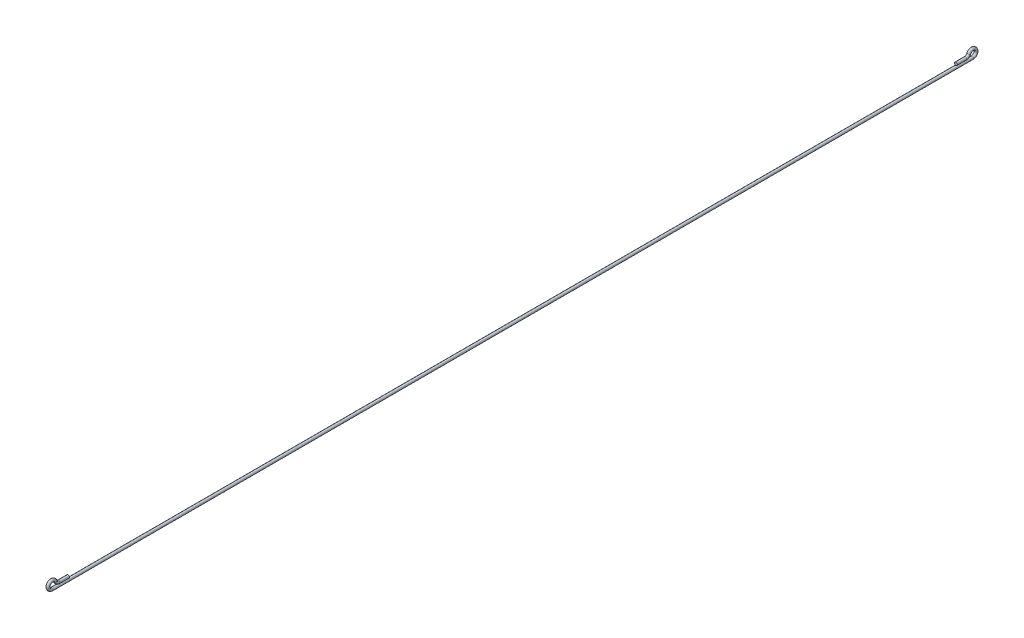
ISO-10303-21;
HEADER;
FILE_DESCRIPTION(('STEP AP214'),'2;1');
FILE_NAME('part.step','',(''),(''),'','','');
FILE_SCHEMA(('AUTOMOTIVE_DESIGN { 1 0 10303 214 1 1 1 1 }'));
ENDSEC;
DATA;
#1=APPLICATION_CONTEXT('core data for automotive mechanical design processes');
#2=APPLICATION_PROTOCOL_DEFINITION('international standard','automotive_design',2000,#1);
#3=PRODUCT_CONTEXT('',#1,'mechanical');
#4=PRODUCT('Part','Part','',(#3));
#5=PRODUCT_RELATED_PRODUCT_CATEGORY('part','',(#4));
#6=PRODUCT_DEFINITION_FORMATION('','',#4);
#7=PRODUCT_DEFINITION_CONTEXT('part definition',#1,'design');
#8=PRODUCT_DEFINITION('design','',#6,#7);
#9=PRODUCT_DEFINITION_SHAPE('','',#8);
#10=(LENGTH_UNIT() NAMED_UNIT(*) SI_UNIT(.MILLI.,.METRE.));
#11=(NAMED_UNIT(*) PLANE_ANGLE_UNIT() SI_UNIT($,.RADIAN.));
#12=(NAMED_UNIT(*) SI_UNIT($,.STERADIAN.) SOLID_ANGLE_UNIT());
#13=UNCERTAINTY_MEASURE_WITH_UNIT(LENGTH_MEASURE(1.E-05),#10,'distance_accuracy_value','');
#14=(GEOMETRIC_REPRESENTATION_CONTEXT(3) GLOBAL_UNCERTAINTY_ASSIGNED_CONTEXT((#13)) GLOBAL_UNIT_ASSIGNED_CONTEXT((#10,
#11,#12)) REPRESENTATION_CONTEXT('',''));
#15=CARTESIAN_POINT('',(0.,0.,0.));
#16=DIRECTION('',(0.,0.,1.));
#17=DIRECTION('',(1.,0.,0.));
#18=AXIS2_PLACEMENT_3D('',#15,#16,#17);
#19=CARTESIAN_POINT('',(0.,-3.,17.4161984870956));
#20=DIRECTION('',(0.,0.,-1.));
#21=DIRECTION('',(0.,1.,0.));
#22=AXIS2_PLACEMENT_3D('',#19,#20,#21);
#23=CYLINDRICAL_SURFACE('',#22,1.5);
#24=CARTESIAN_POINT('',(0.,-3.,17.4161984870956));
#25=DIRECTION('',(0.,0.,-1.));
#26=DIRECTION('',(1.,0.,0.));
#27=AXIS2_PLACEMENT_3D('',#24,#25,#26);
#28=CIRCLE('',#27,1.5);
#29=CARTESIAN_POINT('',(0.,-4.5,17.4161984870956));
#30=VERTEX_POINT('',#29);
#31=EDGE_CURVE('E10',#30,#30,#28,.T.);
#32=ORIENTED_EDGE('',*,*,#31,.T.);
#33=EDGE_LOOP('',(#32));
#34=FACE_BOUND('',#33,.T.);
#35=CARTESIAN_POINT('',(0.,-2.99999999998779,-962.583801512904));
#36=DIRECTION('',(0.,0.,-1.));
#37=DIRECTION('',(1.,0.,0.));
#38=AXIS2_PLACEMENT_3D('',#35,#36,#37);
#39=CIRCLE('',#38,1.5);
#40=CARTESIAN_POINT('',(0.,-4.49999999998773,-962.583801512904));
#41=VERTEX_POINT('',#40);
#42=EDGE_CURVE('E48',#41,#41,#39,.T.);
#43=ORIENTED_EDGE('',*,*,#42,.F.);
#44=EDGE_LOOP('',(#43));
#45=FACE_BOUND('',#44,.T.);
#46=ADVANCED_FACE('F30',(#34,#45),#23,.T.);
#47=CARTESIAN_POINT('',(0.,1.,17.4161984870957));
#48=DIRECTION('',(1.,0.,0.));
#49=DIRECTION('',(0.,0.,-1.));
#50=AXIS2_PLACEMENT_3D('',#47,#48,#49);
#51=TOROIDAL_SURFACE('',#50,4.,1.5);
#52=CARTESIAN_POINT('',(0.,2.5,13.7080992435478));
#53=DIRECTION('',(0.,0.927024810886958,0.374999999999999));
#54=DIRECTION('',(1.,0.,0.));
#55=AXIS2_PLACEMENT_3D('',#52,#53,#54);
#56=CIRCLE('',#55,1.5);
#57=CARTESIAN_POINT('',(0.,3.0625,12.3175620272174));
#58=VERTEX_POINT('',#57);
#59=EDGE_CURVE('E36',#58,#58,#56,.T.);
#60=CARTESIAN_POINT('',(0.,1.,17.4161984870957));
#61=DIRECTION('',(1.,0.,0.));
#62=DIRECTION('',(0.,0.,-1.));
#63=AXIS2_PLACEMENT_3D('',#60,#61,#62);
#64=CIRCLE('',#63,5.5);
#65=EDGE_CURVE('',#58,#30,#64,.T.);
#66=ORIENTED_EDGE('',*,*,#59,.T.);
#67=ORIENTED_EDGE('',*,*,#31,.F.);
#68=ORIENTED_EDGE('',*,*,#65,.T.);
#69=ORIENTED_EDGE('',*,*,#65,.F.);
#70=EDGE_LOOP('',(#66,#68,#67,#69));
#71=FACE_BOUND('',#70,.T.);
#72=ADVANCED_FACE('F79',(#71),#51,.T.);
#73=CARTESIAN_POINT('',(0.,4.,10.));
#74=DIRECTION('',(-1.,0.,0.));
#75=DIRECTION('',(0.,0.,1.));
#76=AXIS2_PLACEMENT_3D('',#73,#74,#75);
#77=TOROIDAL_SURFACE('',#76,4.,1.5);
#78=CARTESIAN_POINT('',(0.,0.,10.));
#79=DIRECTION('',(0.,0.,1.));
#80=DIRECTION('',(1.,0.,0.));
#81=AXIS2_PLACEMENT_3D('',#78,#79,#80);
#82=CIRCLE('',#81,1.5);
#83=CARTESIAN_POINT('',(1.5,0.,10.));
#84=VERTEX_POINT('',#83);
#85=EDGE_CURVE('E40',#84,#84,#82,.T.);
#86=ORIENTED_EDGE('',*,*,#85,.T.);
#87=EDGE_LOOP('',(#86));
#88=FACE_BOUND('',#87,.T.);
#89=ORIENTED_EDGE('',*,*,#59,.F.);
#90=EDGE_LOOP('',(#89));
#91=FACE_BOUND('',#90,.T.);
#92=ADVANCED_FACE('F83',(#88,#91),#77,.T.);
#93=CARTESIAN_POINT('',(0.,0.,10.));
#94=DIRECTION('',(0.,0.,-1.));
#95=DIRECTION('',(-1.,0.,0.));
#96=AXIS2_PLACEMENT_3D('',#93,#94,#95);
#97=CYLINDRICAL_SURFACE('',#96,1.5);
#98=ORIENTED_EDGE('',*,*,#85,.F.);
#99=EDGE_LOOP('',(#98));
#100=FACE_BOUND('',#99,.T.);
#101=CARTESIAN_POINT('',(0.,0.,0.));
#102=DIRECTION('',(0.,0.,1.));
#103=DIRECTION('',(1.,0.,0.));
#104=AXIS2_PLACEMENT_3D('',#101,#102,#103);
#105=CIRCLE('',#104,1.5);
#106=CARTESIAN_POINT('',(1.5,0.,0.));
#107=VERTEX_POINT('',#106);
#108=EDGE_CURVE('E44',#107,#107,#105,.T.);
#109=ORIENTED_EDGE('',*,*,#108,.T.);
#110=EDGE_LOOP('',(#109));
#111=FACE_BOUND('',#110,.T.);
#112=ADVANCED_FACE('F87',(#100,#111),#97,.T.);
#113=CARTESIAN_POINT('',(0.,0.,0.));
#114=DIRECTION('',(0.,0.,1.));
#115=DIRECTION('',(1.,0.,0.));
#116=AXIS2_PLACEMENT_3D('',#113,#114,#115);
#117=PLANE('',#116);
#118=ORIENTED_EDGE('',*,*,#108,.F.);
#119=EDGE_LOOP('',(#118));
#120=FACE_BOUND('',#119,.T.);
#121=ADVANCED_FACE('F74',(#120),#117,.F.);
#122=CARTESIAN_POINT('',(0.,1.00000000001229,-962.583801512904));
#123=DIRECTION('',(-1.,0.,0.));
#124=DIRECTION('',(0.,0.,1.));
#125=AXIS2_PLACEMENT_3D('',#122,#123,#124);
#126=TOROIDAL_SURFACE('',#125,4.00000000000002,1.5);
#127=CARTESIAN_POINT('',(0.,2.50000000001227,-958.875702269356));
#128=DIRECTION('',(0.,-0.927024810886967,0.374999999999979));
#129=DIRECTION('',(1.,0.,0.));
#130=AXIS2_PLACEMENT_3D('',#127,#128,#129);
#131=CIRCLE('',#130,1.5);
#132=CARTESIAN_POINT('',(0.,3.06250000001226,-957.485165053026));
#133=VERTEX_POINT('',#132);
#134=EDGE_CURVE('E52',#133,#133,#131,.T.);
#135=CARTESIAN_POINT('',(0.,1.00000000001229,-962.583801512904));
#136=DIRECTION('',(-1.,0.,0.));
#137=DIRECTION('',(0.,0.,1.));
#138=AXIS2_PLACEMENT_3D('',#135,#136,#137);
#139=CIRCLE('',#138,5.50000000000003);
#140=EDGE_CURVE('',#133,#41,#139,.T.);
#141=ORIENTED_EDGE('',*,*,#134,.F.);
#142=ORIENTED_EDGE('',*,*,#42,.T.);
#143=ORIENTED_EDGE('',*,*,#140,.T.);
#144=ORIENTED_EDGE('',*,*,#140,.F.);
#145=EDGE_LOOP('',(#141,#143,#142,#144));
#146=FACE_BOUND('',#145,.T.);
#147=ADVANCED_FACE('F68',(#146),#126,.T.);
#148=CARTESIAN_POINT('',(0.,4.00000000001211,-955.167603025808));
#149=DIRECTION('',(1.,0.,0.));
#150=DIRECTION('',(0.,0.,-1.));
#151=AXIS2_PLACEMENT_3D('',#148,#149,#150);
#152=TOROIDAL_SURFACE('',#151,4.,1.5);
#153=CARTESIAN_POINT('',(0.,1.21085296391672E-11,-955.167603025809));
#154=DIRECTION('',(0.,0.,1.));
#155=DIRECTION('',(1.,0.,0.));
#156=AXIS2_PLACEMENT_3D('',#153,#154,#155);
#157=CIRCLE('',#156,1.5);
#158=CARTESIAN_POINT('',(1.5,1.21085296391672E-11,-955.167603025809));
#159=VERTEX_POINT('',#158);
#160=EDGE_CURVE('E55',#159,#159,#157,.T.);
#161=ORIENTED_EDGE('',*,*,#160,.F.);
#162=EDGE_LOOP('',(#161));
#163=FACE_BOUND('',#162,.T.);
#164=ORIENTED_EDGE('',*,*,#134,.T.);
#165=EDGE_LOOP('',(#164));
#166=FACE_BOUND('',#165,.T.);
#167=ADVANCED_FACE('F65',(#163,#166),#152,.T.);
#168=CARTESIAN_POINT('',(0.,1.21085296391672E-11,-955.167603025809));
#169=DIRECTION('',(0.,0.,1.));
#170=DIRECTION('',(0.,-1.,0.));
#171=AXIS2_PLACEMENT_3D('',#168,#169,#170);
#172=CYLINDRICAL_SURFACE('',#171,1.5);
#173=ORIENTED_EDGE('',*,*,#160,.T.);
#174=EDGE_LOOP('',(#173));
#175=FACE_BOUND('',#174,.T.);
#176=CARTESIAN_POINT('',(0.,1.1857619235602E-11,-945.167603025809));
#177=DIRECTION('',(0.,0.,1.));
#178=DIRECTION('',(1.,0.,0.));
#179=AXIS2_PLACEMENT_3D('',#176,#177,#178);
#180=CIRCLE('',#179,1.5);
#181=CARTESIAN_POINT('',(1.5,1.1857619235602E-11,-945.167603025809));
#182=VERTEX_POINT('',#181);
#183=EDGE_CURVE('E56',#182,#182,#180,.T.);
#184=ORIENTED_EDGE('',*,*,#183,.F.);
#185=EDGE_LOOP('',(#184));
#186=FACE_BOUND('',#185,.T.);
#187=ADVANCED_FACE('F62',(#175,#186),#172,.T.);
#188=CARTESIAN_POINT('',(0.,1.1857619235602E-11,-945.167603025809));
#189=DIRECTION('',(0.,0.,-1.));
#190=DIRECTION('',(1.,0.,0.));
#191=AXIS2_PLACEMENT_3D('',#188,#189,#190);
#192=PLANE('',#191);
#193=ORIENTED_EDGE('',*,*,#183,.T.);
#194=EDGE_LOOP('',(#193));
#195=FACE_BOUND('',#194,.T.);
#196=ADVANCED_FACE('F100',(#195),#192,.F.);
#197=CLOSED_SHELL('',(#46,#72,#92,#112,#121,#147,#167,#187,#196));
#198=MANIFOLD_SOLID_BREP('B2',#197);
#199=ADVANCED_BREP_SHAPE_REPRESENTATION('',(#18,#198),#14);
#200=SHAPE_DEFINITION_REPRESENTATION(#9,#199);
ENDSEC;
END-ISO-10303-21;
